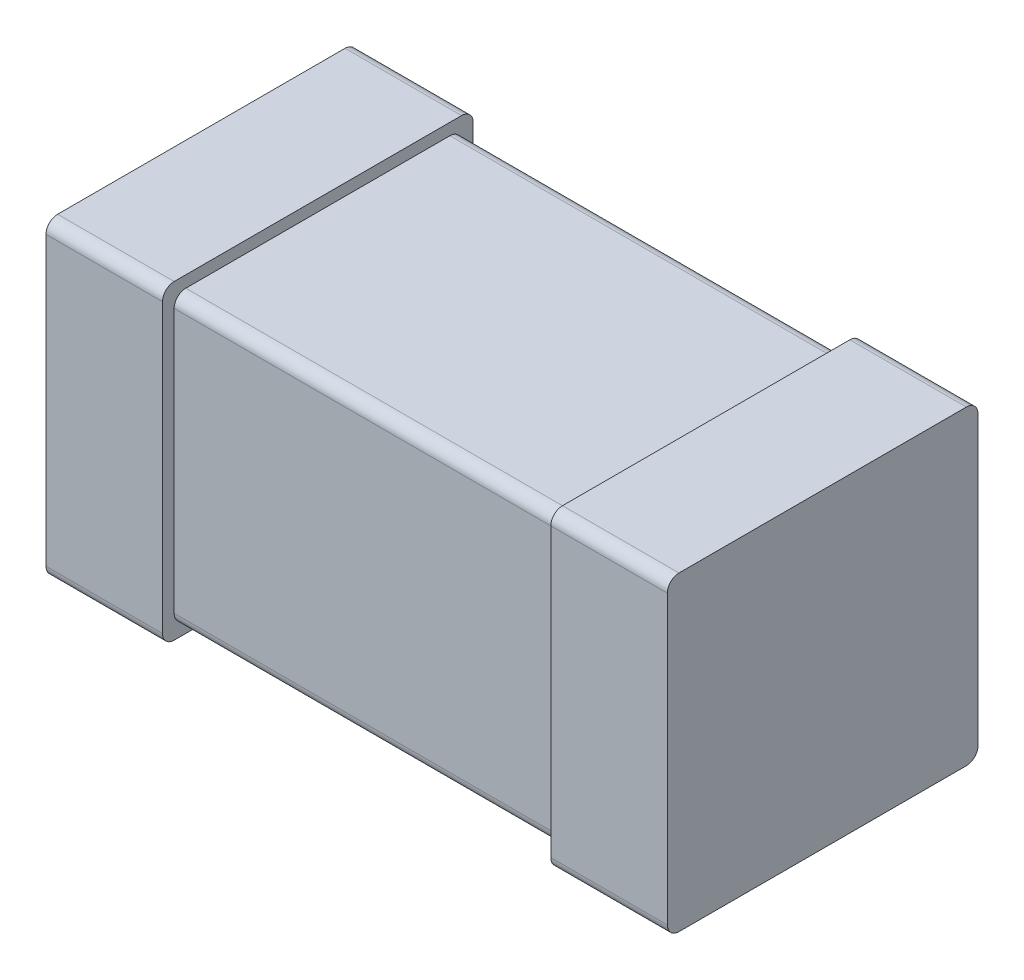
ISO-10303-21;
HEADER;
FILE_DESCRIPTION(('STEP AP214'),'2;1');
FILE_NAME('part.step','',(''),(''),'','','');
FILE_SCHEMA(('AUTOMOTIVE_DESIGN { 1 0 10303 214 1 1 1 1 }'));
ENDSEC;
DATA;
#1=APPLICATION_CONTEXT('core data for automotive mechanical design processes');
#2=APPLICATION_PROTOCOL_DEFINITION('international standard','automotive_design',2000,#1);
#3=PRODUCT_CONTEXT('',#1,'mechanical');
#4=PRODUCT('Part','Part','',(#3));
#5=PRODUCT_RELATED_PRODUCT_CATEGORY('part','',(#4));
#6=PRODUCT_DEFINITION_FORMATION('','',#4);
#7=PRODUCT_DEFINITION_CONTEXT('part definition',#1,'design');
#8=PRODUCT_DEFINITION('design','',#6,#7);
#9=PRODUCT_DEFINITION_SHAPE('','',#8);
#10=(LENGTH_UNIT() NAMED_UNIT(*) SI_UNIT(.MILLI.,.METRE.));
#11=(NAMED_UNIT(*) PLANE_ANGLE_UNIT() SI_UNIT($,.RADIAN.));
#12=(NAMED_UNIT(*) SI_UNIT($,.STERADIAN.) SOLID_ANGLE_UNIT());
#13=UNCERTAINTY_MEASURE_WITH_UNIT(LENGTH_MEASURE(1.E-05),#10,'distance_accuracy_value','');
#14=(GEOMETRIC_REPRESENTATION_CONTEXT(3) GLOBAL_UNCERTAINTY_ASSIGNED_CONTEXT((#13)) GLOBAL_UNIT_ASSIGNED_CONTEXT((#10,
#11,#12)) REPRESENTATION_CONTEXT('',''));
#15=CARTESIAN_POINT('',(0.,0.,0.));
#16=DIRECTION('',(0.,0.,1.));
#17=DIRECTION('',(1.,0.,0.));
#18=AXIS2_PLACEMENT_3D('',#15,#16,#17);
#19=CARTESIAN_POINT('',(0.8,-0.4,0.));
#20=DIRECTION('',(1.,0.,0.));
#21=DIRECTION('',(0.,1.,0.));
#22=AXIS2_PLACEMENT_3D('',#19,#20,#21);
#23=PLANE('',#22);
#24=DIRECTION('',(0.,0.,1.));
#25=VECTOR('',#24,1.);
#26=CARTESIAN_POINT('',(0.8,-0.4,0.));
#27=LINE('',#26,#25);
#28=CARTESIAN_POINT('',(0.8,-0.4,0.03));
#29=VERTEX_POINT('',#28);
#30=CARTESIAN_POINT('',(0.8,-0.4,0.77));
#31=VERTEX_POINT('',#30);
#32=EDGE_CURVE('E315',#29,#31,#27,.T.);
#33=ORIENTED_EDGE('',*,*,#32,.F.);
#34=CARTESIAN_POINT('',(0.8,-0.37,0.03));
#35=DIRECTION('',(1.,0.,0.));
#36=DIRECTION('',(0.,0.,1.));
#37=AXIS2_PLACEMENT_3D('',#34,#35,#36);
#38=CIRCLE('',#37,0.03);
#39=CARTESIAN_POINT('',(0.8,-0.37,0.));
#40=VERTEX_POINT('',#39);
#41=EDGE_CURVE('E314',#29,#40,#38,.T.);
#42=ORIENTED_EDGE('',*,*,#41,.T.);
#43=DIRECTION('',(0.,1.,0.));
#44=VECTOR('',#43,1.);
#45=CARTESIAN_POINT('',(0.8,-0.4,0.));
#46=LINE('',#45,#44);
#47=CARTESIAN_POINT('',(0.8,0.37,0.));
#48=VERTEX_POINT('',#47);
#49=EDGE_CURVE('E361',#40,#48,#46,.T.);
#50=ORIENTED_EDGE('',*,*,#49,.T.);
#51=CARTESIAN_POINT('',(0.8,0.37,0.03));
#52=DIRECTION('',(-1.,0.,0.));
#53=DIRECTION('',(0.,0.,1.));
#54=AXIS2_PLACEMENT_3D('',#51,#52,#53);
#55=CIRCLE('',#54,0.03);
#56=CARTESIAN_POINT('',(0.8,0.4,0.03));
#57=VERTEX_POINT('',#56);
#58=EDGE_CURVE('E250',#57,#48,#55,.T.);
#59=ORIENTED_EDGE('',*,*,#58,.F.);
#60=DIRECTION('',(0.,0.,1.));
#61=VECTOR('',#60,1.);
#62=CARTESIAN_POINT('',(0.8,0.4,0.));
#63=LINE('',#62,#61);
#64=CARTESIAN_POINT('',(0.8,0.4,0.77));
#65=VERTEX_POINT('',#64);
#66=EDGE_CURVE('E11',#57,#65,#63,.T.);
#67=ORIENTED_EDGE('',*,*,#66,.T.);
#68=CARTESIAN_POINT('',(0.8,0.37,0.77));
#69=DIRECTION('',(1.,0.,0.));
#70=DIRECTION('',(0.,0.,1.));
#71=AXIS2_PLACEMENT_3D('',#68,#69,#70);
#72=CIRCLE('',#71,0.03);
#73=CARTESIAN_POINT('',(0.8,0.37,0.8));
#74=VERTEX_POINT('',#73);
#75=EDGE_CURVE('E396',#65,#74,#72,.T.);
#76=ORIENTED_EDGE('',*,*,#75,.T.);
#77=DIRECTION('',(0.,1.,0.));
#78=VECTOR('',#77,1.);
#79=CARTESIAN_POINT('',(0.8,-0.4,0.8));
#80=LINE('',#79,#78);
#81=CARTESIAN_POINT('',(0.8,-0.37,0.8));
#82=VERTEX_POINT('',#81);
#83=EDGE_CURVE('E358',#82,#74,#80,.T.);
#84=ORIENTED_EDGE('',*,*,#83,.F.);
#85=CARTESIAN_POINT('',(0.8,-0.37,0.77));
#86=DIRECTION('',(-1.,0.,0.));
#87=DIRECTION('',(0.,0.,1.));
#88=AXIS2_PLACEMENT_3D('',#85,#86,#87);
#89=CIRCLE('',#88,0.03);
#90=EDGE_CURVE('E345',#31,#82,#89,.T.);
#91=ORIENTED_EDGE('',*,*,#90,.F.);
#92=EDGE_LOOP('',(#33,#42,#50,#59,#67,#76,#84,#91));
#93=FACE_BOUND('',#92,.T.);
#94=ADVANCED_FACE('F17',(#93),#23,.T.);
#95=CARTESIAN_POINT('',(0.5,0.4,0.));
#96=DIRECTION('',(0.,1.,0.));
#97=DIRECTION('',(1.,0.,0.));
#98=AXIS2_PLACEMENT_3D('',#95,#96,#97);
#99=PLANE('',#98);
#100=ORIENTED_EDGE('',*,*,#66,.F.);
#101=DIRECTION('',(1.,0.,0.));
#102=VECTOR('',#101,1.);
#103=CARTESIAN_POINT('',(0.5,0.4,0.03));
#104=LINE('',#103,#102);
#105=CARTESIAN_POINT('',(0.5,0.4,0.03));
#106=VERTEX_POINT('',#105);
#107=EDGE_CURVE('E357',#106,#57,#104,.T.);
#108=ORIENTED_EDGE('',*,*,#107,.F.);
#109=DIRECTION('',(0.,0.,1.));
#110=VECTOR('',#109,1.);
#111=CARTESIAN_POINT('',(0.5,0.4,0.));
#112=LINE('',#111,#110);
#113=CARTESIAN_POINT('',(0.5,0.4,0.77));
#114=VERTEX_POINT('',#113);
#115=EDGE_CURVE('E383',#106,#114,#112,.T.);
#116=ORIENTED_EDGE('',*,*,#115,.T.);
#117=DIRECTION('',(1.,0.,0.));
#118=VECTOR('',#117,1.);
#119=CARTESIAN_POINT('',(0.5,0.4,0.77));
#120=LINE('',#119,#118);
#121=EDGE_CURVE('E28',#114,#65,#120,.T.);
#122=ORIENTED_EDGE('',*,*,#121,.T.);
#123=EDGE_LOOP('',(#100,#108,#116,#122));
#124=FACE_BOUND('',#123,.T.);
#125=ADVANCED_FACE('F489',(#124),#99,.T.);
#126=CARTESIAN_POINT('',(0.5,0.37,0.77));
#127=DIRECTION('',(1.,0.,0.));
#128=DIRECTION('',(0.,1.,0.));
#129=AXIS2_PLACEMENT_3D('',#126,#127,#128);
#130=CYLINDRICAL_SURFACE('',#129,0.03);
#131=CARTESIAN_POINT('',(0.5,0.37,0.77));
#132=DIRECTION('',(1.,0.,0.));
#133=DIRECTION('',(0.,0.,1.));
#134=AXIS2_PLACEMENT_3D('',#131,#132,#133);
#135=CIRCLE('',#134,0.03);
#136=CARTESIAN_POINT('',(0.5,0.37,0.8));
#137=VERTEX_POINT('',#136);
#138=EDGE_CURVE('E307',#114,#137,#135,.T.);
#139=ORIENTED_EDGE('',*,*,#138,.T.);
#140=DIRECTION('',(1.,0.,0.));
#141=VECTOR('',#140,1.);
#142=CARTESIAN_POINT('',(0.5,0.37,0.8));
#143=LINE('',#142,#141);
#144=EDGE_CURVE('E353',#137,#74,#143,.T.);
#145=ORIENTED_EDGE('',*,*,#144,.T.);
#146=ORIENTED_EDGE('',*,*,#75,.F.);
#147=ORIENTED_EDGE('',*,*,#121,.F.);
#148=EDGE_LOOP('',(#139,#145,#146,#147));
#149=FACE_BOUND('',#148,.T.);
#150=ADVANCED_FACE('F492',(#149),#130,.T.);
#151=CARTESIAN_POINT('',(0.5,0.37,0.03));
#152=DIRECTION('',(1.,0.,0.));
#153=DIRECTION('',(0.,1.,0.));
#154=AXIS2_PLACEMENT_3D('',#151,#152,#153);
#155=CYLINDRICAL_SURFACE('',#154,0.03);
#156=ORIENTED_EDGE('',*,*,#107,.T.);
#157=ORIENTED_EDGE('',*,*,#58,.T.);
#158=DIRECTION('',(1.,0.,0.));
#159=VECTOR('',#158,1.);
#160=CARTESIAN_POINT('',(0.5,0.37,0.));
#161=LINE('',#160,#159);
#162=CARTESIAN_POINT('',(0.5,0.37,0.));
#163=VERTEX_POINT('',#162);
#164=EDGE_CURVE('E365',#163,#48,#161,.T.);
#165=ORIENTED_EDGE('',*,*,#164,.F.);
#166=CARTESIAN_POINT('',(0.5,0.37,0.03));
#167=DIRECTION('',(-1.,0.,0.));
#168=DIRECTION('',(0.,0.,1.));
#169=AXIS2_PLACEMENT_3D('',#166,#167,#168);
#170=CIRCLE('',#169,0.03);
#171=EDGE_CURVE('E378',#106,#163,#170,.T.);
#172=ORIENTED_EDGE('',*,*,#171,.F.);
#173=EDGE_LOOP('',(#156,#157,#165,#172));
#174=FACE_BOUND('',#173,.T.);
#175=ADVANCED_FACE('F477',(#174),#155,.T.);
#176=CARTESIAN_POINT('',(0.5,-0.4,0.8));
#177=DIRECTION('',(0.,0.,1.));
#178=DIRECTION('',(1.,0.,0.));
#179=AXIS2_PLACEMENT_3D('',#176,#177,#178);
#180=PLANE('',#179);
#181=DIRECTION('',(0.,1.,0.));
#182=VECTOR('',#181,1.);
#183=CARTESIAN_POINT('',(0.5,-0.4,0.8));
#184=LINE('',#183,#182);
#185=CARTESIAN_POINT('',(0.5,-0.37,0.8));
#186=VERTEX_POINT('',#185);
#187=EDGE_CURVE('E304',#186,#137,#184,.T.);
#188=ORIENTED_EDGE('',*,*,#187,.F.);
#189=DIRECTION('',(1.,0.,0.));
#190=VECTOR('',#189,1.);
#191=CARTESIAN_POINT('',(0.5,-0.37,0.8));
#192=LINE('',#191,#190);
#193=EDGE_CURVE('E349',#186,#82,#192,.T.);
#194=ORIENTED_EDGE('',*,*,#193,.T.);
#195=ORIENTED_EDGE('',*,*,#83,.T.);
#196=ORIENTED_EDGE('',*,*,#144,.F.);
#197=EDGE_LOOP('',(#188,#194,#195,#196));
#198=FACE_BOUND('',#197,.T.);
#199=ADVANCED_FACE('F500',(#198),#180,.T.);
#200=CARTESIAN_POINT('',(0.5,-0.4,0.));
#201=DIRECTION('',(0.,0.,1.));
#202=DIRECTION('',(1.,0.,0.));
#203=AXIS2_PLACEMENT_3D('',#200,#201,#202);
#204=PLANE('',#203);
#205=ORIENTED_EDGE('',*,*,#164,.T.);
#206=ORIENTED_EDGE('',*,*,#49,.F.);
#207=DIRECTION('',(1.,0.,0.));
#208=VECTOR('',#207,1.);
#209=CARTESIAN_POINT('',(0.5,-0.37,0.));
#210=LINE('',#209,#208);
#211=CARTESIAN_POINT('',(0.5,-0.37,0.));
#212=VERTEX_POINT('',#211);
#213=EDGE_CURVE('E310',#212,#40,#210,.T.);
#214=ORIENTED_EDGE('',*,*,#213,.F.);
#215=DIRECTION('',(0.,1.,0.));
#216=VECTOR('',#215,1.);
#217=CARTESIAN_POINT('',(0.5,-0.4,0.));
#218=LINE('',#217,#216);
#219=EDGE_CURVE('E382',#212,#163,#218,.T.);
#220=ORIENTED_EDGE('',*,*,#219,.T.);
#221=EDGE_LOOP('',(#205,#206,#214,#220));
#222=FACE_BOUND('',#221,.T.);
#223=ADVANCED_FACE('F482',(#222),#204,.F.);
#224=CARTESIAN_POINT('',(0.5,-0.37,0.77));
#225=DIRECTION('',(1.,0.,0.));
#226=DIRECTION('',(0.,-1.,0.));
#227=AXIS2_PLACEMENT_3D('',#224,#225,#226);
#228=CYLINDRICAL_SURFACE('',#227,0.03);
#229=DIRECTION('',(1.,0.,0.));
#230=VECTOR('',#229,1.);
#231=CARTESIAN_POINT('',(0.5,-0.4,0.77));
#232=LINE('',#231,#230);
#233=CARTESIAN_POINT('',(0.5,-0.4,0.77));
#234=VERTEX_POINT('',#233);
#235=EDGE_CURVE('E340',#234,#31,#232,.T.);
#236=ORIENTED_EDGE('',*,*,#235,.T.);
#237=ORIENTED_EDGE('',*,*,#90,.T.);
#238=ORIENTED_EDGE('',*,*,#193,.F.);
#239=CARTESIAN_POINT('',(0.5,-0.37,0.77));
#240=DIRECTION('',(-1.,0.,0.));
#241=DIRECTION('',(0.,0.,1.));
#242=AXIS2_PLACEMENT_3D('',#239,#240,#241);
#243=CIRCLE('',#242,0.03);
#244=EDGE_CURVE('E308',#234,#186,#243,.T.);
#245=ORIENTED_EDGE('',*,*,#244,.F.);
#246=EDGE_LOOP('',(#236,#237,#238,#245));
#247=FACE_BOUND('',#246,.T.);
#248=ADVANCED_FACE('F503',(#247),#228,.T.);
#249=CARTESIAN_POINT('',(0.5,-0.37,0.03));
#250=DIRECTION('',(1.,0.,0.));
#251=DIRECTION('',(0.,-1.,0.));
#252=AXIS2_PLACEMENT_3D('',#249,#250,#251);
#253=CYLINDRICAL_SURFACE('',#252,0.03);
#254=CARTESIAN_POINT('',(0.5,-0.37,0.03));
#255=DIRECTION('',(1.,0.,0.));
#256=DIRECTION('',(0.,0.,1.));
#257=AXIS2_PLACEMENT_3D('',#254,#255,#256);
#258=CIRCLE('',#257,0.03);
#259=CARTESIAN_POINT('',(0.5,-0.4,0.03));
#260=VERTEX_POINT('',#259);
#261=EDGE_CURVE('E341',#260,#212,#258,.T.);
#262=ORIENTED_EDGE('',*,*,#261,.T.);
#263=ORIENTED_EDGE('',*,*,#213,.T.);
#264=ORIENTED_EDGE('',*,*,#41,.F.);
#265=DIRECTION('',(1.,0.,0.));
#266=VECTOR('',#265,1.);
#267=CARTESIAN_POINT('',(0.5,-0.4,0.03));
#268=LINE('',#267,#266);
#269=EDGE_CURVE('E433',#260,#29,#268,.T.);
#270=ORIENTED_EDGE('',*,*,#269,.F.);
#271=EDGE_LOOP('',(#262,#263,#264,#270));
#272=FACE_BOUND('',#271,.T.);
#273=ADVANCED_FACE('F513',(#272),#253,.T.);
#274=CARTESIAN_POINT('',(0.5,-0.4,0.));
#275=DIRECTION('',(0.,1.,0.));
#276=DIRECTION('',(1.,0.,0.));
#277=AXIS2_PLACEMENT_3D('',#274,#275,#276);
#278=PLANE('',#277);
#279=ORIENTED_EDGE('',*,*,#235,.F.);
#280=DIRECTION('',(0.,0.,1.));
#281=VECTOR('',#280,1.);
#282=CARTESIAN_POINT('',(0.5,-0.4,0.));
#283=LINE('',#282,#281);
#284=EDGE_CURVE('E336',#260,#234,#283,.T.);
#285=ORIENTED_EDGE('',*,*,#284,.F.);
#286=ORIENTED_EDGE('',*,*,#269,.T.);
#287=ORIENTED_EDGE('',*,*,#32,.T.);
#288=EDGE_LOOP('',(#279,#285,#286,#287));
#289=FACE_BOUND('',#288,.T.);
#290=ADVANCED_FACE('F508',(#289),#278,.F.);
#291=CARTESIAN_POINT('',(0.5,-0.4,0.));
#292=DIRECTION('',(1.,0.,0.));
#293=DIRECTION('',(0.,1.,0.));
#294=AXIS2_PLACEMENT_3D('',#291,#292,#293);
#295=PLANE('',#294);
#296=DIRECTION('',(0.,1.,0.));
#297=VECTOR('',#296,1.);
#298=CARTESIAN_POINT('',(0.5,-0.37,0.03));
#299=LINE('',#298,#297);
#300=CARTESIAN_POINT('',(0.5,-0.34,0.03));
#301=VERTEX_POINT('',#300);
#302=CARTESIAN_POINT('',(0.5,0.34,0.03));
#303=VERTEX_POINT('',#302);
#304=EDGE_CURVE('E223',#301,#303,#299,.T.);
#305=ORIENTED_EDGE('',*,*,#304,.T.);
#306=CARTESIAN_POINT('',(0.5,0.34,0.06));
#307=DIRECTION('',(-1.,0.,0.));
#308=DIRECTION('',(0.,0.,1.));
#309=AXIS2_PLACEMENT_3D('',#306,#307,#308);
#310=CIRCLE('',#309,0.03);
#311=CARTESIAN_POINT('',(0.5,0.37,0.06));
#312=VERTEX_POINT('',#311);
#313=EDGE_CURVE('E222',#312,#303,#310,.T.);
#314=ORIENTED_EDGE('',*,*,#313,.F.);
#315=DIRECTION('',(0.,0.,1.));
#316=VECTOR('',#315,1.);
#317=CARTESIAN_POINT('',(0.5,0.37,0.03));
#318=LINE('',#317,#316);
#319=CARTESIAN_POINT('',(0.5,0.37,0.74));
#320=VERTEX_POINT('',#319);
#321=EDGE_CURVE('E217',#312,#320,#318,.T.);
#322=ORIENTED_EDGE('',*,*,#321,.T.);
#323=CARTESIAN_POINT('',(0.5,0.34,0.74));
#324=DIRECTION('',(1.,0.,0.));
#325=DIRECTION('',(0.,0.,1.));
#326=AXIS2_PLACEMENT_3D('',#323,#324,#325);
#327=CIRCLE('',#326,0.03);
#328=CARTESIAN_POINT('',(0.5,0.34,0.77));
#329=VERTEX_POINT('',#328);
#330=EDGE_CURVE('E303',#320,#329,#327,.T.);
#331=ORIENTED_EDGE('',*,*,#330,.T.);
#332=DIRECTION('',(0.,1.,0.));
#333=VECTOR('',#332,1.);
#334=CARTESIAN_POINT('',(0.5,-0.37,0.77));
#335=LINE('',#334,#333);
#336=CARTESIAN_POINT('',(0.5,-0.34,0.77));
#337=VERTEX_POINT('',#336);
#338=EDGE_CURVE('E302',#337,#329,#335,.T.);
#339=ORIENTED_EDGE('',*,*,#338,.F.);
#340=CARTESIAN_POINT('',(0.5,-0.34,0.74));
#341=DIRECTION('',(-1.,0.,0.));
#342=DIRECTION('',(0.,0.,1.));
#343=AXIS2_PLACEMENT_3D('',#340,#341,#342);
#344=CIRCLE('',#343,0.03);
#345=CARTESIAN_POINT('',(0.5,-0.37,0.74));
#346=VERTEX_POINT('',#345);
#347=EDGE_CURVE('E320',#346,#337,#344,.T.);
#348=ORIENTED_EDGE('',*,*,#347,.F.);
#349=DIRECTION('',(0.,0.,1.));
#350=VECTOR('',#349,1.);
#351=CARTESIAN_POINT('',(0.5,-0.37,0.03));
#352=LINE('',#351,#350);
#353=CARTESIAN_POINT('',(0.5,-0.37,0.06));
#354=VERTEX_POINT('',#353);
#355=EDGE_CURVE('E387',#354,#346,#352,.T.);
#356=ORIENTED_EDGE('',*,*,#355,.F.);
#357=CARTESIAN_POINT('',(0.5,-0.34,0.06));
#358=DIRECTION('',(1.,0.,0.));
#359=DIRECTION('',(0.,0.,1.));
#360=AXIS2_PLACEMENT_3D('',#357,#358,#359);
#361=CIRCLE('',#360,0.03);
#362=EDGE_CURVE('E257',#354,#301,#361,.T.);
#363=ORIENTED_EDGE('',*,*,#362,.T.);
#364=EDGE_LOOP('',(#305,#314,#322,#331,#339,#348,#356,#363));
#365=FACE_BOUND('',#364,.T.);
#366=ORIENTED_EDGE('',*,*,#244,.T.);
#367=ORIENTED_EDGE('',*,*,#187,.T.);
#368=ORIENTED_EDGE('',*,*,#138,.F.);
#369=ORIENTED_EDGE('',*,*,#115,.F.);
#370=ORIENTED_EDGE('',*,*,#171,.T.);
#371=ORIENTED_EDGE('',*,*,#219,.F.);
#372=ORIENTED_EDGE('',*,*,#261,.F.);
#373=ORIENTED_EDGE('',*,*,#284,.T.);
#374=EDGE_LOOP('',(#366,#367,#368,#369,#370,#371,#372,#373));
#375=FACE_BOUND('',#374,.T.);
#376=ADVANCED_FACE('F416',(#365,#375),#295,.F.);
#377=CARTESIAN_POINT('',(-0.5,-0.37,0.03));
#378=DIRECTION('',(0.,1.,0.));
#379=DIRECTION('',(1.,0.,0.));
#380=AXIS2_PLACEMENT_3D('',#377,#378,#379);
#381=PLANE('',#380);
#382=DIRECTION('',(1.,0.,0.));
#383=VECTOR('',#382,1.);
#384=CARTESIAN_POINT('',(-0.5,-0.37,0.74));
#385=LINE('',#384,#383);
#386=CARTESIAN_POINT('',(-0.5,-0.37,0.74));
#387=VERTEX_POINT('',#386);
#388=EDGE_CURVE('E316',#387,#346,#385,.T.);
#389=ORIENTED_EDGE('',*,*,#388,.F.);
#390=DIRECTION('',(0.,0.,1.));
#391=VECTOR('',#390,1.);
#392=CARTESIAN_POINT('',(-0.5,-0.37,0.03));
#393=LINE('',#392,#391);
#394=CARTESIAN_POINT('',(-0.5,-0.37,0.06));
#395=VERTEX_POINT('',#394);
#396=EDGE_CURVE('E275',#395,#387,#393,.T.);
#397=ORIENTED_EDGE('',*,*,#396,.F.);
#398=DIRECTION('',(1.,0.,0.));
#399=VECTOR('',#398,1.);
#400=CARTESIAN_POINT('',(-0.5,-0.37,0.06));
#401=LINE('',#400,#399);
#402=EDGE_CURVE('E260',#395,#354,#401,.T.);
#403=ORIENTED_EDGE('',*,*,#402,.T.);
#404=ORIENTED_EDGE('',*,*,#355,.T.);
#405=EDGE_LOOP('',(#389,#397,#403,#404));
#406=FACE_BOUND('',#405,.T.);
#407=ADVANCED_FACE('F595',(#406),#381,.F.);
#408=CARTESIAN_POINT('',(-0.5,-0.34,0.74));
#409=DIRECTION('',(1.,0.,0.));
#410=DIRECTION('',(0.,-1.,0.));
#411=AXIS2_PLACEMENT_3D('',#408,#409,#410);
#412=CYLINDRICAL_SURFACE('',#411,0.03);
#413=ORIENTED_EDGE('',*,*,#388,.T.);
#414=ORIENTED_EDGE('',*,*,#347,.T.);
#415=DIRECTION('',(1.,0.,0.));
#416=VECTOR('',#415,1.);
#417=CARTESIAN_POINT('',(-0.5,-0.34,0.77));
#418=LINE('',#417,#416);
#419=CARTESIAN_POINT('',(-0.5,-0.34,0.77));
#420=VERTEX_POINT('',#419);
#421=EDGE_CURVE('E298',#420,#337,#418,.T.);
#422=ORIENTED_EDGE('',*,*,#421,.F.);
#423=CARTESIAN_POINT('',(-0.5,-0.34,0.74));
#424=DIRECTION('',(-1.,0.,0.));
#425=DIRECTION('',(0.,0.,1.));
#426=AXIS2_PLACEMENT_3D('',#423,#424,#425);
#427=CIRCLE('',#426,0.03);
#428=EDGE_CURVE('E329',#387,#420,#427,.T.);
#429=ORIENTED_EDGE('',*,*,#428,.F.);
#430=EDGE_LOOP('',(#413,#414,#422,#429));
#431=FACE_BOUND('',#430,.T.);
#432=ADVANCED_FACE('F597',(#431),#412,.T.);
#433=CARTESIAN_POINT('',(-0.5,-0.37,0.77));
#434=DIRECTION('',(0.,0.,1.));
#435=DIRECTION('',(1.,0.,0.));
#436=AXIS2_PLACEMENT_3D('',#433,#434,#435);
#437=PLANE('',#436);
#438=DIRECTION('',(0.,1.,0.));
#439=VECTOR('',#438,1.);
#440=CARTESIAN_POINT('',(-0.5,-0.37,0.77));
#441=LINE('',#440,#439);
#442=CARTESIAN_POINT('',(-0.5,0.34,0.77));
#443=VERTEX_POINT('',#442);
#444=EDGE_CURVE('E246',#420,#443,#441,.T.);
#445=ORIENTED_EDGE('',*,*,#444,.F.);
#446=ORIENTED_EDGE('',*,*,#421,.T.);
#447=ORIENTED_EDGE('',*,*,#338,.T.);
#448=DIRECTION('',(1.,0.,0.));
#449=VECTOR('',#448,1.);
#450=CARTESIAN_POINT('',(-0.5,0.34,0.77));
#451=LINE('',#450,#449);
#452=EDGE_CURVE('E323',#443,#329,#451,.T.);
#453=ORIENTED_EDGE('',*,*,#452,.F.);
#454=EDGE_LOOP('',(#445,#446,#447,#453));
#455=FACE_BOUND('',#454,.T.);
#456=ADVANCED_FACE('F422',(#455),#437,.T.);
#457=CARTESIAN_POINT('',(-0.5,0.34,0.74));
#458=DIRECTION('',(1.,0.,0.));
#459=DIRECTION('',(0.,1.,0.));
#460=AXIS2_PLACEMENT_3D('',#457,#458,#459);
#461=CYLINDRICAL_SURFACE('',#460,0.03);
#462=CARTESIAN_POINT('',(-0.5,0.34,0.74));
#463=DIRECTION('',(1.,0.,0.));
#464=DIRECTION('',(0.,0.,1.));
#465=AXIS2_PLACEMENT_3D('',#462,#463,#464);
#466=CIRCLE('',#465,0.03);
#467=CARTESIAN_POINT('',(-0.5,0.37,0.74));
#468=VERTEX_POINT('',#467);
#469=EDGE_CURVE('E239',#468,#443,#466,.T.);
#470=ORIENTED_EDGE('',*,*,#469,.T.);
#471=ORIENTED_EDGE('',*,*,#452,.T.);
#472=ORIENTED_EDGE('',*,*,#330,.F.);
#473=DIRECTION('',(1.,0.,0.));
#474=VECTOR('',#473,1.);
#475=CARTESIAN_POINT('',(-0.5,0.37,0.74));
#476=LINE('',#475,#474);
#477=EDGE_CURVE('E202',#468,#320,#476,.T.);
#478=ORIENTED_EDGE('',*,*,#477,.F.);
#479=EDGE_LOOP('',(#470,#471,#472,#478));
#480=FACE_BOUND('',#479,.T.);
#481=ADVANCED_FACE('F419',(#480),#461,.T.);
#482=CARTESIAN_POINT('',(-0.5,0.37,0.03));
#483=DIRECTION('',(0.,1.,0.));
#484=DIRECTION('',(1.,0.,0.));
#485=AXIS2_PLACEMENT_3D('',#482,#483,#484);
#486=PLANE('',#485);
#487=ORIENTED_EDGE('',*,*,#321,.F.);
#488=DIRECTION('',(1.,0.,0.));
#489=VECTOR('',#488,1.);
#490=CARTESIAN_POINT('',(-0.5,0.37,0.06));
#491=LINE('',#490,#489);
#492=CARTESIAN_POINT('',(-0.5,0.37,0.06));
#493=VERTEX_POINT('',#492);
#494=EDGE_CURVE('E210',#493,#312,#491,.T.);
#495=ORIENTED_EDGE('',*,*,#494,.F.);
#496=DIRECTION('',(0.,0.,1.));
#497=VECTOR('',#496,1.);
#498=CARTESIAN_POINT('',(-0.5,0.37,0.03));
#499=LINE('',#498,#497);
#500=EDGE_CURVE('E214',#493,#468,#499,.T.);
#501=ORIENTED_EDGE('',*,*,#500,.T.);
#502=ORIENTED_EDGE('',*,*,#477,.T.);
#503=EDGE_LOOP('',(#487,#495,#501,#502));
#504=FACE_BOUND('',#503,.T.);
#505=ADVANCED_FACE('F212',(#504),#486,.T.);
#506=CARTESIAN_POINT('',(-0.5,0.34,0.06));
#507=DIRECTION('',(1.,0.,0.));
#508=DIRECTION('',(0.,1.,0.));
#509=AXIS2_PLACEMENT_3D('',#506,#507,#508);
#510=CYLINDRICAL_SURFACE('',#509,0.03);
#511=ORIENTED_EDGE('',*,*,#494,.T.);
#512=ORIENTED_EDGE('',*,*,#313,.T.);
#513=DIRECTION('',(1.,0.,0.));
#514=VECTOR('',#513,1.);
#515=CARTESIAN_POINT('',(-0.5,0.34,0.03));
#516=LINE('',#515,#514);
#517=CARTESIAN_POINT('',(-0.5,0.34,0.03));
#518=VERTEX_POINT('',#517);
#519=EDGE_CURVE('E229',#518,#303,#516,.T.);
#520=ORIENTED_EDGE('',*,*,#519,.F.);
#521=CARTESIAN_POINT('',(-0.5,0.34,0.06));
#522=DIRECTION('',(-1.,0.,0.));
#523=DIRECTION('',(0.,0.,1.));
#524=AXIS2_PLACEMENT_3D('',#521,#522,#523);
#525=CIRCLE('',#524,0.03);
#526=EDGE_CURVE('E226',#493,#518,#525,.T.);
#527=ORIENTED_EDGE('',*,*,#526,.F.);
#528=EDGE_LOOP('',(#511,#512,#520,#527));
#529=FACE_BOUND('',#528,.T.);
#530=ADVANCED_FACE('F227',(#529),#510,.T.);
#531=CARTESIAN_POINT('',(-0.5,-0.37,0.03));
#532=DIRECTION('',(0.,0.,1.));
#533=DIRECTION('',(1.,0.,0.));
#534=AXIS2_PLACEMENT_3D('',#531,#532,#533);
#535=PLANE('',#534);
#536=ORIENTED_EDGE('',*,*,#519,.T.);
#537=ORIENTED_EDGE('',*,*,#304,.F.);
#538=DIRECTION('',(1.,0.,0.));
#539=VECTOR('',#538,1.);
#540=CARTESIAN_POINT('',(-0.5,-0.34,0.03));
#541=LINE('',#540,#539);
#542=CARTESIAN_POINT('',(-0.5,-0.34,0.03));
#543=VERTEX_POINT('',#542);
#544=EDGE_CURVE('E261',#543,#301,#541,.T.);
#545=ORIENTED_EDGE('',*,*,#544,.F.);
#546=DIRECTION('',(0.,1.,0.));
#547=VECTOR('',#546,1.);
#548=CARTESIAN_POINT('',(-0.5,-0.37,0.03));
#549=LINE('',#548,#547);
#550=EDGE_CURVE('E234',#543,#518,#549,.T.);
#551=ORIENTED_EDGE('',*,*,#550,.T.);
#552=EDGE_LOOP('',(#536,#537,#545,#551));
#553=FACE_BOUND('',#552,.T.);
#554=ADVANCED_FACE('F588',(#553),#535,.F.);
#555=CARTESIAN_POINT('',(-0.5,-0.34,0.06));
#556=DIRECTION('',(1.,0.,0.));
#557=DIRECTION('',(0.,-1.,0.));
#558=AXIS2_PLACEMENT_3D('',#555,#556,#557);
#559=CYLINDRICAL_SURFACE('',#558,0.03);
#560=CARTESIAN_POINT('',(-0.5,-0.34,0.06));
#561=DIRECTION('',(1.,0.,0.));
#562=DIRECTION('',(0.,0.,1.));
#563=AXIS2_PLACEMENT_3D('',#560,#561,#562);
#564=CIRCLE('',#563,0.03);
#565=EDGE_CURVE('E271',#395,#543,#564,.T.);
#566=ORIENTED_EDGE('',*,*,#565,.T.);
#567=ORIENTED_EDGE('',*,*,#544,.T.);
#568=ORIENTED_EDGE('',*,*,#362,.F.);
#569=ORIENTED_EDGE('',*,*,#402,.F.);
#570=EDGE_LOOP('',(#566,#567,#568,#569));
#571=FACE_BOUND('',#570,.T.);
#572=ADVANCED_FACE('F591',(#571),#559,.T.);
#573=CARTESIAN_POINT('',(-0.5,-0.4,0.));
#574=DIRECTION('',(1.,0.,0.));
#575=DIRECTION('',(0.,1.,0.));
#576=AXIS2_PLACEMENT_3D('',#573,#574,#575);
#577=PLANE('',#576);
#578=ORIENTED_EDGE('',*,*,#565,.F.);
#579=ORIENTED_EDGE('',*,*,#396,.T.);
#580=ORIENTED_EDGE('',*,*,#428,.T.);
#581=ORIENTED_EDGE('',*,*,#444,.T.);
#582=ORIENTED_EDGE('',*,*,#469,.F.);
#583=ORIENTED_EDGE('',*,*,#500,.F.);
#584=ORIENTED_EDGE('',*,*,#526,.T.);
#585=ORIENTED_EDGE('',*,*,#550,.F.);
#586=EDGE_LOOP('',(#578,#579,#580,#581,#582,#583,#584,#585));
#587=FACE_BOUND('',#586,.T.);
#588=DIRECTION('',(0.,0.,1.));
#589=VECTOR('',#588,1.);
#590=CARTESIAN_POINT('',(-0.5,-0.4,0.));
#591=LINE('',#590,#589);
#592=CARTESIAN_POINT('',(-0.5,-0.4,0.03));
#593=VERTEX_POINT('',#592);
#594=CARTESIAN_POINT('',(-0.5,-0.4,0.77));
#595=VERTEX_POINT('',#594);
#596=EDGE_CURVE('E283',#593,#595,#591,.T.);
#597=ORIENTED_EDGE('',*,*,#596,.F.);
#598=CARTESIAN_POINT('',(-0.5,-0.37,0.03));
#599=DIRECTION('',(1.,0.,0.));
#600=DIRECTION('',(0.,0.,1.));
#601=AXIS2_PLACEMENT_3D('',#598,#599,#600);
#602=CIRCLE('',#601,0.03);
#603=CARTESIAN_POINT('',(-0.5,-0.37,0.));
#604=VERTEX_POINT('',#603);
#605=EDGE_CURVE('E435',#593,#604,#602,.T.);
#606=ORIENTED_EDGE('',*,*,#605,.T.);
#607=DIRECTION('',(0.,1.,0.));
#608=VECTOR('',#607,1.);
#609=CARTESIAN_POINT('',(-0.5,-0.4,0.));
#610=LINE('',#609,#608);
#611=CARTESIAN_POINT('',(-0.5,0.37,0.));
#612=VERTEX_POINT('',#611);
#613=EDGE_CURVE('E254',#604,#612,#610,.T.);
#614=ORIENTED_EDGE('',*,*,#613,.T.);
#615=CARTESIAN_POINT('',(-0.5,0.37,0.03));
#616=DIRECTION('',(-1.,0.,0.));
#617=DIRECTION('',(0.,0.,1.));
#618=AXIS2_PLACEMENT_3D('',#615,#616,#617);
#619=CIRCLE('',#618,0.03);
#620=CARTESIAN_POINT('',(-0.5,0.4,0.03));
#621=VERTEX_POINT('',#620);
#622=EDGE_CURVE('E154',#621,#612,#619,.T.);
#623=ORIENTED_EDGE('',*,*,#622,.F.);
#624=DIRECTION('',(0.,0.,1.));
#625=VECTOR('',#624,1.);
#626=CARTESIAN_POINT('',(-0.5,0.4,0.));
#627=LINE('',#626,#625);
#628=CARTESIAN_POINT('',(-0.5,0.4,0.77));
#629=VERTEX_POINT('',#628);
#630=EDGE_CURVE('E276',#621,#629,#627,.T.);
#631=ORIENTED_EDGE('',*,*,#630,.T.);
#632=CARTESIAN_POINT('',(-0.5,0.37,0.77));
#633=DIRECTION('',(1.,0.,0.));
#634=DIRECTION('',(0.,0.,1.));
#635=AXIS2_PLACEMENT_3D('',#632,#633,#634);
#636=CIRCLE('',#635,0.03);
#637=CARTESIAN_POINT('',(-0.5,0.37,0.8));
#638=VERTEX_POINT('',#637);
#639=EDGE_CURVE('E294',#629,#638,#636,.T.);
#640=ORIENTED_EDGE('',*,*,#639,.T.);
#641=DIRECTION('',(0.,1.,0.));
#642=VECTOR('',#641,1.);
#643=CARTESIAN_POINT('',(-0.5,-0.4,0.8));
#644=LINE('',#643,#642);
#645=CARTESIAN_POINT('',(-0.5,-0.37,0.8));
#646=VERTEX_POINT('',#645);
#647=EDGE_CURVE('E168',#646,#638,#644,.T.);
#648=ORIENTED_EDGE('',*,*,#647,.F.);
#649=CARTESIAN_POINT('',(-0.5,-0.37,0.77));
#650=DIRECTION('',(-1.,0.,0.));
#651=DIRECTION('',(0.,0.,1.));
#652=AXIS2_PLACEMENT_3D('',#649,#650,#651);
#653=CIRCLE('',#652,0.03);
#654=EDGE_CURVE('E439',#595,#646,#653,.T.);
#655=ORIENTED_EDGE('',*,*,#654,.F.);
#656=EDGE_LOOP('',(#597,#606,#614,#623,#631,#640,#648,#655));
#657=FACE_BOUND('',#656,.T.);
#658=ADVANCED_FACE('F237',(#587,#657),#577,.T.);
#659=CARTESIAN_POINT('',(-0.8,0.4,0.));
#660=DIRECTION('',(0.,1.,0.));
#661=DIRECTION('',(1.,0.,0.));
#662=AXIS2_PLACEMENT_3D('',#659,#660,#661);
#663=PLANE('',#662);
#664=ORIENTED_EDGE('',*,*,#630,.F.);
#665=DIRECTION('',(1.,0.,0.));
#666=VECTOR('',#665,1.);
#667=CARTESIAN_POINT('',(-0.8,0.4,0.03));
#668=LINE('',#667,#666);
#669=CARTESIAN_POINT('',(-0.8,0.4,0.03));
#670=VERTEX_POINT('',#669);
#671=EDGE_CURVE('E295',#670,#621,#668,.T.);
#672=ORIENTED_EDGE('',*,*,#671,.F.);
#673=DIRECTION('',(0.,0.,1.));
#674=VECTOR('',#673,1.);
#675=CARTESIAN_POINT('',(-0.8,0.4,0.));
#676=LINE('',#675,#674);
#677=CARTESIAN_POINT('',(-0.8,0.4,0.77));
#678=VERTEX_POINT('',#677);
#679=EDGE_CURVE('E21',#670,#678,#676,.T.);
#680=ORIENTED_EDGE('',*,*,#679,.T.);
#681=DIRECTION('',(1.,0.,0.));
#682=VECTOR('',#681,1.);
#683=CARTESIAN_POINT('',(-0.8,0.4,0.77));
#684=LINE('',#683,#682);
#685=EDGE_CURVE('E440',#678,#629,#684,.T.);
#686=ORIENTED_EDGE('',*,*,#685,.T.);
#687=EDGE_LOOP('',(#664,#672,#680,#686));
#688=FACE_BOUND('',#687,.T.);
#689=ADVANCED_FACE('F622',(#688),#663,.T.);
#690=CARTESIAN_POINT('',(-0.8,0.37,0.77));
#691=DIRECTION('',(1.,0.,0.));
#692=DIRECTION('',(0.,1.,0.));
#693=AXIS2_PLACEMENT_3D('',#690,#691,#692);
#694=CYLINDRICAL_SURFACE('',#693,0.03);
#695=CARTESIAN_POINT('',(-0.8,0.37,0.77));
#696=DIRECTION('',(1.,0.,0.));
#697=DIRECTION('',(0.,0.,1.));
#698=AXIS2_PLACEMENT_3D('',#695,#696,#697);
#699=CIRCLE('',#698,0.03);
#700=CARTESIAN_POINT('',(-0.8,0.37,0.8));
#701=VERTEX_POINT('',#700);
#702=EDGE_CURVE('E266',#678,#701,#699,.T.);
#703=ORIENTED_EDGE('',*,*,#702,.T.);
#704=DIRECTION('',(1.,0.,0.));
#705=VECTOR('',#704,1.);
#706=CARTESIAN_POINT('',(-0.8,0.37,0.8));
#707=LINE('',#706,#705);
#708=EDGE_CURVE('E253',#701,#638,#707,.T.);
#709=ORIENTED_EDGE('',*,*,#708,.T.);
#710=ORIENTED_EDGE('',*,*,#639,.F.);
#711=ORIENTED_EDGE('',*,*,#685,.F.);
#712=EDGE_LOOP('',(#703,#709,#710,#711));
#713=FACE_BOUND('',#712,.T.);
#714=ADVANCED_FACE('F625',(#713),#694,.T.);
#715=CARTESIAN_POINT('',(-0.8,0.37,0.03));
#716=DIRECTION('',(1.,0.,0.));
#717=DIRECTION('',(0.,1.,0.));
#718=AXIS2_PLACEMENT_3D('',#715,#716,#717);
#719=CYLINDRICAL_SURFACE('',#718,0.03);
#720=ORIENTED_EDGE('',*,*,#671,.T.);
#721=ORIENTED_EDGE('',*,*,#622,.T.);
#722=DIRECTION('',(1.,0.,0.));
#723=VECTOR('',#722,1.);
#724=CARTESIAN_POINT('',(-0.8,0.37,0.));
#725=LINE('',#724,#723);
#726=CARTESIAN_POINT('',(-0.8,0.37,0.));
#727=VERTEX_POINT('',#726);
#728=EDGE_CURVE('E335',#727,#612,#725,.T.);
#729=ORIENTED_EDGE('',*,*,#728,.F.);
#730=CARTESIAN_POINT('',(-0.8,0.37,0.03));
#731=DIRECTION('',(-1.,0.,0.));
#732=DIRECTION('',(0.,0.,1.));
#733=AXIS2_PLACEMENT_3D('',#730,#731,#732);
#734=CIRCLE('',#733,0.03);
#735=EDGE_CURVE('E369',#670,#727,#734,.T.);
#736=ORIENTED_EDGE('',*,*,#735,.F.);
#737=EDGE_LOOP('',(#720,#721,#729,#736));
#738=FACE_BOUND('',#737,.T.);
#739=ADVANCED_FACE('F635',(#738),#719,.T.);
#740=CARTESIAN_POINT('',(-0.8,-0.4,0.8));
#741=DIRECTION('',(0.,0.,1.));
#742=DIRECTION('',(1.,0.,0.));
#743=AXIS2_PLACEMENT_3D('',#740,#741,#742);
#744=PLANE('',#743);
#745=DIRECTION('',(0.,1.,0.));
#746=VECTOR('',#745,1.);
#747=CARTESIAN_POINT('',(-0.8,-0.4,0.8));
#748=LINE('',#747,#746);
#749=CARTESIAN_POINT('',(-0.8,-0.37,0.8));
#750=VERTEX_POINT('',#749);
#751=EDGE_CURVE('E270',#750,#701,#748,.T.);
#752=ORIENTED_EDGE('',*,*,#751,.F.);
#753=DIRECTION('',(1.,0.,0.));
#754=VECTOR('',#753,1.);
#755=CARTESIAN_POINT('',(-0.8,-0.37,0.8));
#756=LINE('',#755,#754);
#757=EDGE_CURVE('E545',#750,#646,#756,.T.);
#758=ORIENTED_EDGE('',*,*,#757,.T.);
#759=ORIENTED_EDGE('',*,*,#647,.T.);
#760=ORIENTED_EDGE('',*,*,#708,.F.);
#761=EDGE_LOOP('',(#752,#758,#759,#760));
#762=FACE_BOUND('',#761,.T.);
#763=ADVANCED_FACE('F618',(#762),#744,.T.);
#764=CARTESIAN_POINT('',(-0.8,-0.4,0.));
#765=DIRECTION('',(0.,0.,1.));
#766=DIRECTION('',(1.,0.,0.));
#767=AXIS2_PLACEMENT_3D('',#764,#765,#766);
#768=PLANE('',#767);
#769=ORIENTED_EDGE('',*,*,#728,.T.);
#770=ORIENTED_EDGE('',*,*,#613,.F.);
#771=DIRECTION('',(1.,0.,0.));
#772=VECTOR('',#771,1.);
#773=CARTESIAN_POINT('',(-0.8,-0.37,0.));
#774=LINE('',#773,#772);
#775=CARTESIAN_POINT('',(-0.8,-0.37,0.));
#776=VERTEX_POINT('',#775);
#777=EDGE_CURVE('E287',#776,#604,#774,.T.);
#778=ORIENTED_EDGE('',*,*,#777,.F.);
#779=DIRECTION('',(0.,1.,0.));
#780=VECTOR('',#779,1.);
#781=CARTESIAN_POINT('',(-0.8,-0.4,0.));
#782=LINE('',#781,#780);
#783=EDGE_CURVE('E373',#776,#727,#782,.T.);
#784=ORIENTED_EDGE('',*,*,#783,.T.);
#785=EDGE_LOOP('',(#769,#770,#778,#784));
#786=FACE_BOUND('',#785,.T.);
#787=ADVANCED_FACE('F527',(#786),#768,.F.);
#788=CARTESIAN_POINT('',(-0.8,-0.37,0.77));
#789=DIRECTION('',(1.,0.,0.));
#790=DIRECTION('',(0.,-1.,0.));
#791=AXIS2_PLACEMENT_3D('',#788,#789,#790);
#792=CYLINDRICAL_SURFACE('',#791,0.03);
#793=DIRECTION('',(1.,0.,0.));
#794=VECTOR('',#793,1.);
#795=CARTESIAN_POINT('',(-0.8,-0.4,0.77));
#796=LINE('',#795,#794);
#797=CARTESIAN_POINT('',(-0.8,-0.4,0.77));
#798=VERTEX_POINT('',#797);
#799=EDGE_CURVE('E281',#798,#595,#796,.T.);
#800=ORIENTED_EDGE('',*,*,#799,.T.);
#801=ORIENTED_EDGE('',*,*,#654,.T.);
#802=ORIENTED_EDGE('',*,*,#757,.F.);
#803=CARTESIAN_POINT('',(-0.8,-0.37,0.77));
#804=DIRECTION('',(-1.,0.,0.));
#805=DIRECTION('',(0.,0.,1.));
#806=AXIS2_PLACEMENT_3D('',#803,#804,#805);
#807=CIRCLE('',#806,0.03);
#808=EDGE_CURVE('E377',#798,#750,#807,.T.);
#809=ORIENTED_EDGE('',*,*,#808,.F.);
#810=EDGE_LOOP('',(#800,#801,#802,#809));
#811=FACE_BOUND('',#810,.T.);
#812=ADVANCED_FACE('F566',(#811),#792,.T.);
#813=CARTESIAN_POINT('',(-0.8,-0.37,0.03));
#814=DIRECTION('',(1.,0.,0.));
#815=DIRECTION('',(0.,-1.,0.));
#816=AXIS2_PLACEMENT_3D('',#813,#814,#815);
#817=CYLINDRICAL_SURFACE('',#816,0.03);
#818=CARTESIAN_POINT('',(-0.8,-0.37,0.03));
#819=DIRECTION('',(1.,0.,0.));
#820=DIRECTION('',(0.,0.,1.));
#821=AXIS2_PLACEMENT_3D('',#818,#819,#820);
#822=CIRCLE('',#821,0.03);
#823=CARTESIAN_POINT('',(-0.8,-0.4,0.03));
#824=VERTEX_POINT('',#823);
#825=EDGE_CURVE('E282',#824,#776,#822,.T.);
#826=ORIENTED_EDGE('',*,*,#825,.T.);
#827=ORIENTED_EDGE('',*,*,#777,.T.);
#828=ORIENTED_EDGE('',*,*,#605,.F.);
#829=DIRECTION('',(1.,0.,0.));
#830=VECTOR('',#829,1.);
#831=CARTESIAN_POINT('',(-0.8,-0.4,0.03));
#832=LINE('',#831,#830);
#833=EDGE_CURVE('E288',#824,#593,#832,.T.);
#834=ORIENTED_EDGE('',*,*,#833,.F.);
#835=EDGE_LOOP('',(#826,#827,#828,#834));
#836=FACE_BOUND('',#835,.T.);
#837=ADVANCED_FACE('F531',(#836),#817,.T.);
#838=CARTESIAN_POINT('',(-0.8,-0.4,0.));
#839=DIRECTION('',(0.,1.,0.));
#840=DIRECTION('',(1.,0.,0.));
#841=AXIS2_PLACEMENT_3D('',#838,#839,#840);
#842=PLANE('',#841);
#843=ORIENTED_EDGE('',*,*,#799,.F.);
#844=DIRECTION('',(0.,0.,1.));
#845=VECTOR('',#844,1.);
#846=CARTESIAN_POINT('',(-0.8,-0.4,0.));
#847=LINE('',#846,#845);
#848=EDGE_CURVE('E277',#824,#798,#847,.T.);
#849=ORIENTED_EDGE('',*,*,#848,.F.);
#850=ORIENTED_EDGE('',*,*,#833,.T.);
#851=ORIENTED_EDGE('',*,*,#596,.T.);
#852=EDGE_LOOP('',(#843,#849,#850,#851));
#853=FACE_BOUND('',#852,.T.);
#854=ADVANCED_FACE('F571',(#853),#842,.F.);
#855=CARTESIAN_POINT('',(-0.8,-0.4,0.));
#856=DIRECTION('',(1.,0.,0.));
#857=DIRECTION('',(0.,1.,0.));
#858=AXIS2_PLACEMENT_3D('',#855,#856,#857);
#859=PLANE('',#858);
#860=ORIENTED_EDGE('',*,*,#808,.T.);
#861=ORIENTED_EDGE('',*,*,#751,.T.);
#862=ORIENTED_EDGE('',*,*,#702,.F.);
#863=ORIENTED_EDGE('',*,*,#679,.F.);
#864=ORIENTED_EDGE('',*,*,#735,.T.);
#865=ORIENTED_EDGE('',*,*,#783,.F.);
#866=ORIENTED_EDGE('',*,*,#825,.F.);
#867=ORIENTED_EDGE('',*,*,#848,.T.);
#868=EDGE_LOOP('',(#860,#861,#862,#863,#864,#865,#866,#867));
#869=FACE_BOUND('',#868,.T.);
#870=ADVANCED_FACE('F19',(#869),#859,.F.);
#871=CLOSED_SHELL('',(#94,#125,#150,#175,#199,#223,#248,#273,#290,#376,#407,#432,#456,#481,#505,
#530,#554,#572,#658,#689,#714,#739,#763,#787,#812,#837,#854,#870));
#872=MANIFOLD_SOLID_BREP('B1',#871);
#873=ADVANCED_BREP_SHAPE_REPRESENTATION('',(#18,#872),#14);
#874=SHAPE_DEFINITION_REPRESENTATION(#9,#873);
ENDSEC;
END-ISO-10303-21;
